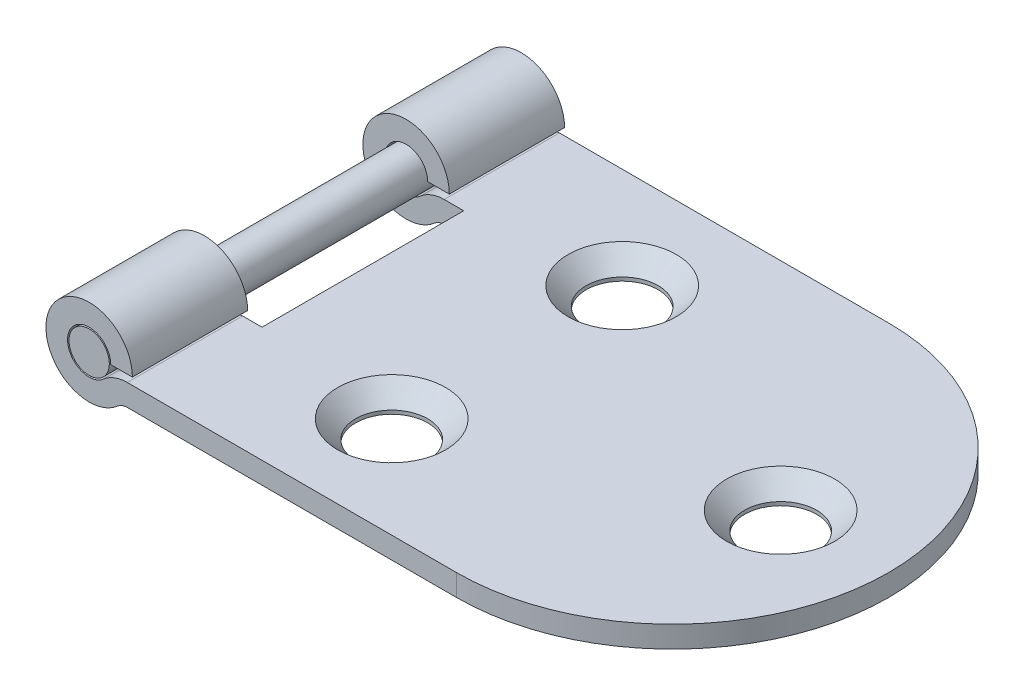
ISO-10303-21;
HEADER;
FILE_DESCRIPTION(('STEP AP214'),'2;1');
FILE_NAME('part.step','',(''),(''),'','','');
FILE_SCHEMA(('AUTOMOTIVE_DESIGN { 1 0 10303 214 1 1 1 1 }'));
ENDSEC;
DATA;
#1=APPLICATION_CONTEXT('core data for automotive mechanical design processes');
#2=APPLICATION_PROTOCOL_DEFINITION('international standard','automotive_design',2000,#1);
#3=PRODUCT_CONTEXT('',#1,'mechanical');
#4=PRODUCT('Part','Part','',(#3));
#5=PRODUCT_RELATED_PRODUCT_CATEGORY('part','',(#4));
#6=PRODUCT_DEFINITION_FORMATION('','',#4);
#7=PRODUCT_DEFINITION_CONTEXT('part definition',#1,'design');
#8=PRODUCT_DEFINITION('design','',#6,#7);
#9=PRODUCT_DEFINITION_SHAPE('','',#8);
#10=(LENGTH_UNIT() NAMED_UNIT(*) SI_UNIT(.MILLI.,.METRE.));
#11=(NAMED_UNIT(*) PLANE_ANGLE_UNIT() SI_UNIT($,.RADIAN.));
#12=(NAMED_UNIT(*) SI_UNIT($,.STERADIAN.) SOLID_ANGLE_UNIT());
#13=UNCERTAINTY_MEASURE_WITH_UNIT(LENGTH_MEASURE(1.E-05),#10,'distance_accuracy_value','');
#14=(GEOMETRIC_REPRESENTATION_CONTEXT(3) GLOBAL_UNCERTAINTY_ASSIGNED_CONTEXT((#13)) GLOBAL_UNIT_ASSIGNED_CONTEXT((#10,
#11,#12)) REPRESENTATION_CONTEXT('',''));
#15=CARTESIAN_POINT('',(0.,0.,0.));
#16=DIRECTION('',(0.,0.,1.));
#17=DIRECTION('',(1.,0.,0.));
#18=AXIS2_PLACEMENT_3D('',#15,#16,#17);
#19=CARTESIAN_POINT('',(0.,2.,18.9597979746447));
#20=DIRECTION('',(0.,0.,-1.));
#21=DIRECTION('',(-1.,0.,0.));
#22=AXIS2_PLACEMENT_3D('',#19,#20,#21);
#23=CYLINDRICAL_SURFACE('',#22,1.4);
#24=CARTESIAN_POINT('',(0.,2.,15.));
#25=DIRECTION('',(0.,0.,1.));
#26=DIRECTION('',(1.,0.,0.));
#27=AXIS2_PLACEMENT_3D('',#24,#25,#26);
#28=CIRCLE('',#27,1.4);
#29=CARTESIAN_POINT('',(1.4,2.,15.));
#30=VERTEX_POINT('',#29);
#31=EDGE_CURVE('E12',#30,#30,#28,.T.);
#32=ORIENTED_EDGE('',*,*,#31,.F.);
#33=EDGE_LOOP('',(#32));
#34=FACE_BOUND('',#33,.T.);
#35=CARTESIAN_POINT('',(0.,2.,-15.));
#36=DIRECTION('',(0.,0.,1.));
#37=DIRECTION('',(1.,0.,0.));
#38=AXIS2_PLACEMENT_3D('',#35,#36,#37);
#39=CIRCLE('',#38,1.4);
#40=CARTESIAN_POINT('',(1.4,2.,-15.));
#41=VERTEX_POINT('',#40);
#42=EDGE_CURVE('E73',#41,#41,#39,.F.);
#43=ORIENTED_EDGE('',*,*,#42,.F.);
#44=EDGE_LOOP('',(#43));
#45=FACE_BOUND('',#44,.T.);
#46=ADVANCED_FACE('F66',(#34,#45),#23,.T.);
#47=CARTESIAN_POINT('',(2.64575131106459,-1.,15.));
#48=DIRECTION('',(0.,0.,1.));
#49=DIRECTION('',(1.,0.,0.));
#50=AXIS2_PLACEMENT_3D('',#47,#48,#49);
#51=PLANE('',#50);
#52=ORIENTED_EDGE('',*,*,#31,.T.);
#53=EDGE_LOOP('',(#52));
#54=FACE_BOUND('',#53,.T.);
#55=ADVANCED_FACE('F68',(#54),#51,.T.);
#56=CARTESIAN_POINT('',(2.64575131106459,-1.,-15.));
#57=DIRECTION('',(0.,0.,1.));
#58=DIRECTION('',(1.,0.,0.));
#59=AXIS2_PLACEMENT_3D('',#56,#57,#58);
#60=PLANE('',#59);
#61=ORIENTED_EDGE('',*,*,#42,.T.);
#62=EDGE_LOOP('',(#61));
#63=FACE_BOUND('',#62,.T.);
#64=ADVANCED_FACE('F79',(#63),#60,.F.);
#65=CLOSED_SHELL('',(#46,#55,#64));
#66=MANIFOLD_SOLID_BREP('B2',#65);
#67=CARTESIAN_POINT('',(2.64575131106459,-1.,15.));
#68=DIRECTION('',(0.,0.,-1.));
#69=DIRECTION('',(-1.,0.,0.));
#70=AXIS2_PLACEMENT_3D('',#67,#68,#69);
#71=CYLINDRICAL_SURFACE('',#70,2.5);
#72=DIRECTION('',(0.,0.,-1.));
#73=VECTOR('',#72,1.);
#74=CARTESIAN_POINT('',(0.99215674164922,0.875,15.));
#75=LINE('',#74,#73);
#76=CARTESIAN_POINT('',(0.99215674164922,0.875,-7.));
#77=VERTEX_POINT('',#76);
#78=CARTESIAN_POINT('',(0.99215674164922,0.875,-15.));
#79=VERTEX_POINT('',#78);
#80=EDGE_CURVE('E348',#77,#79,#75,.T.);
#81=ORIENTED_EDGE('',*,*,#80,.F.);
#82=CARTESIAN_POINT('',(2.64575131106459,-1.,-7.));
#83=DIRECTION('',(0.,0.,-1.));
#84=DIRECTION('',(-1.,0.,0.));
#85=AXIS2_PLACEMENT_3D('',#82,#83,#84);
#86=CIRCLE('',#85,2.5);
#87=CARTESIAN_POINT('',(2.64575131106459,1.5,-7.));
#88=VERTEX_POINT('',#87);
#89=EDGE_CURVE('E253',#77,#88,#86,.T.);
#90=ORIENTED_EDGE('',*,*,#89,.T.);
#91=DIRECTION('',(0.,0.,-1.));
#92=VECTOR('',#91,1.);
#93=CARTESIAN_POINT('',(2.64575131106459,1.5,15.));
#94=LINE('',#93,#92);
#95=CARTESIAN_POINT('',(2.64575131106459,1.5,-15.));
#96=VERTEX_POINT('',#95);
#97=EDGE_CURVE('E311',#88,#96,#94,.T.);
#98=ORIENTED_EDGE('',*,*,#97,.T.);
#99=CARTESIAN_POINT('',(2.64575131106459,-1.,-15.));
#100=DIRECTION('',(0.,0.,1.));
#101=DIRECTION('',(1.,0.,0.));
#102=AXIS2_PLACEMENT_3D('',#99,#100,#101);
#103=CIRCLE('',#102,2.5);
#104=EDGE_CURVE('E293',#96,#79,#103,.T.);
#105=ORIENTED_EDGE('',*,*,#104,.T.);
#106=EDGE_LOOP('',(#81,#90,#98,#105));
#107=FACE_BOUND('',#106,.T.);
#108=ADVANCED_FACE('F106',(#107),#71,.T.);
#109=CARTESIAN_POINT('',(0.,2.,15.));
#110=DIRECTION('',(0.,0.,-1.));
#111=DIRECTION('',(-1.,0.,0.));
#112=AXIS2_PLACEMENT_3D('',#109,#110,#111);
#113=CYLINDRICAL_SURFACE('',#112,1.5);
#114=DIRECTION('',(0.,0.,-1.));
#115=VECTOR('',#114,1.);
#116=CARTESIAN_POINT('',(1.5,2.,15.));
#117=LINE('',#116,#115);
#118=CARTESIAN_POINT('',(1.5,2.,-7.));
#119=VERTEX_POINT('',#118);
#120=CARTESIAN_POINT('',(1.5,2.,-15.));
#121=VERTEX_POINT('',#120);
#122=EDGE_CURVE('E344',#119,#121,#117,.T.);
#123=ORIENTED_EDGE('',*,*,#122,.F.);
#124=CARTESIAN_POINT('',(0.,2.,-7.));
#125=DIRECTION('',(0.,0.,-1.));
#126=DIRECTION('',(-1.,0.,0.));
#127=AXIS2_PLACEMENT_3D('',#124,#125,#126);
#128=CIRCLE('',#127,1.5);
#129=EDGE_CURVE('E250',#119,#77,#128,.F.);
#130=ORIENTED_EDGE('',*,*,#129,.T.);
#131=ORIENTED_EDGE('',*,*,#80,.T.);
#132=CARTESIAN_POINT('',(0.,2.,-15.));
#133=DIRECTION('',(0.,0.,-1.));
#134=DIRECTION('',(1.,0.,0.));
#135=AXIS2_PLACEMENT_3D('',#132,#133,#134);
#136=CIRCLE('',#135,1.5);
#137=EDGE_CURVE('E314',#79,#121,#136,.T.);
#138=ORIENTED_EDGE('',*,*,#137,.T.);
#139=EDGE_LOOP('',(#123,#130,#131,#138));
#140=FACE_BOUND('',#139,.T.);
#141=ADVANCED_FACE('F387',(#140),#113,.F.);
#142=CARTESIAN_POINT('',(1.5,2.,15.));
#143=DIRECTION('',(0.,1.,0.));
#144=DIRECTION('',(0.,0.,1.));
#145=AXIS2_PLACEMENT_3D('',#142,#143,#144);
#146=PLANE('',#145);
#147=DIRECTION('',(0.,0.,-1.));
#148=VECTOR('',#147,1.);
#149=CARTESIAN_POINT('',(3.,2.,15.));
#150=LINE('',#149,#148);
#151=CARTESIAN_POINT('',(3.,2.,-7.));
#152=VERTEX_POINT('',#151);
#153=CARTESIAN_POINT('',(3.,2.,-15.));
#154=VERTEX_POINT('',#153);
#155=EDGE_CURVE('E340',#152,#154,#150,.T.);
#156=ORIENTED_EDGE('',*,*,#155,.F.);
#157=DIRECTION('',(-1.,0.,0.));
#158=VECTOR('',#157,1.);
#159=CARTESIAN_POINT('',(1.49999999999999,2.,-7.));
#160=LINE('',#159,#158);
#161=EDGE_CURVE('E247',#152,#119,#160,.T.);
#162=ORIENTED_EDGE('',*,*,#161,.T.);
#163=ORIENTED_EDGE('',*,*,#122,.T.);
#164=DIRECTION('',(1.,0.,0.));
#165=VECTOR('',#164,1.);
#166=CARTESIAN_POINT('',(1.5,2.,-15.));
#167=LINE('',#166,#165);
#168=EDGE_CURVE('E317',#121,#154,#167,.T.);
#169=ORIENTED_EDGE('',*,*,#168,.T.);
#170=EDGE_LOOP('',(#156,#162,#163,#169));
#171=FACE_BOUND('',#170,.T.);
#172=ADVANCED_FACE('F390',(#171),#146,.F.);
#173=CARTESIAN_POINT('',(0.,2.,15.));
#174=DIRECTION('',(0.,0.,-1.));
#175=DIRECTION('',(-1.,0.,0.));
#176=AXIS2_PLACEMENT_3D('',#173,#174,#175);
#177=CYLINDRICAL_SURFACE('',#176,3.);
#178=DIRECTION('',(0.,0.,-1.));
#179=VECTOR('',#178,1.);
#180=CARTESIAN_POINT('',(1.98431348329844,-0.25,15.));
#181=LINE('',#180,#179);
#182=CARTESIAN_POINT('',(1.98431348329844,-0.25,-7.));
#183=VERTEX_POINT('',#182);
#184=CARTESIAN_POINT('',(1.98431348329844,-0.25,-15.));
#185=VERTEX_POINT('',#184);
#186=EDGE_CURVE('E336',#183,#185,#181,.T.);
#187=ORIENTED_EDGE('',*,*,#186,.F.);
#188=CARTESIAN_POINT('',(0.,2.,-7.));
#189=DIRECTION('',(0.,0.,-1.));
#190=DIRECTION('',(-1.,0.,0.));
#191=AXIS2_PLACEMENT_3D('',#188,#189,#190);
#192=CIRCLE('',#191,3.);
#193=EDGE_CURVE('E238',#183,#152,#192,.T.);
#194=ORIENTED_EDGE('',*,*,#193,.T.);
#195=ORIENTED_EDGE('',*,*,#155,.T.);
#196=CARTESIAN_POINT('',(0.,2.,-15.));
#197=DIRECTION('',(0.,0.,1.));
#198=DIRECTION('',(1.,0.,0.));
#199=AXIS2_PLACEMENT_3D('',#196,#197,#198);
#200=CIRCLE('',#199,3.);
#201=EDGE_CURVE('E320',#154,#185,#200,.T.);
#202=ORIENTED_EDGE('',*,*,#201,.T.);
#203=EDGE_LOOP('',(#187,#194,#195,#202));
#204=FACE_BOUND('',#203,.T.);
#205=ADVANCED_FACE('F364',(#204),#177,.T.);
#206=CARTESIAN_POINT('',(2.64575131106459,-1.,15.));
#207=DIRECTION('',(0.,0.,-1.));
#208=DIRECTION('',(-1.,0.,0.));
#209=AXIS2_PLACEMENT_3D('',#206,#207,#208);
#210=CYLINDRICAL_SURFACE('',#209,1.);
#211=DIRECTION('',(0.,0.,-1.));
#212=VECTOR('',#211,1.);
#213=CARTESIAN_POINT('',(2.64575131106459,0.,15.));
#214=LINE('',#213,#212);
#215=CARTESIAN_POINT('',(2.64575131106459,0.,-7.));
#216=VERTEX_POINT('',#215);
#217=CARTESIAN_POINT('',(2.64575131106459,0.,-15.));
#218=VERTEX_POINT('',#217);
#219=EDGE_CURVE('E334',#216,#218,#214,.T.);
#220=ORIENTED_EDGE('',*,*,#219,.F.);
#221=CARTESIAN_POINT('',(2.64575131106459,-1.,-7.));
#222=DIRECTION('',(0.,0.,-1.));
#223=DIRECTION('',(-1.,0.,0.));
#224=AXIS2_PLACEMENT_3D('',#221,#222,#223);
#225=CIRCLE('',#224,1.);
#226=EDGE_CURVE('E114',#216,#183,#225,.F.);
#227=ORIENTED_EDGE('',*,*,#226,.T.);
#228=ORIENTED_EDGE('',*,*,#186,.T.);
#229=CARTESIAN_POINT('',(2.64575131106459,-1.,-15.));
#230=DIRECTION('',(0.,0.,-1.));
#231=DIRECTION('',(1.,0.,0.));
#232=AXIS2_PLACEMENT_3D('',#229,#230,#231);
#233=CIRCLE('',#232,1.);
#234=EDGE_CURVE('E323',#185,#218,#233,.T.);
#235=ORIENTED_EDGE('',*,*,#234,.T.);
#236=EDGE_LOOP('',(#220,#227,#228,#235));
#237=FACE_BOUND('',#236,.T.);
#238=ADVANCED_FACE('F361',(#237),#210,.F.);
#239=CARTESIAN_POINT('',(2.64575131106459,1.5,15.));
#240=DIRECTION('',(0.,-1.,0.));
#241=DIRECTION('',(1.,0.,0.));
#242=AXIS2_PLACEMENT_3D('',#239,#240,#241);
#243=PLANE('',#242);
#244=CARTESIAN_POINT('',(14.,1.5,-8.));
#245=DIRECTION('',(0.,1.,0.));
#246=DIRECTION('',(0.,0.,1.));
#247=AXIS2_PLACEMENT_3D('',#244,#245,#246);
#248=CIRCLE('',#247,3.75);
#249=CARTESIAN_POINT('',(14.,1.5,-4.25));
#250=VERTEX_POINT('',#249);
#251=EDGE_CURVE('E263',#250,#250,#248,.T.);
#252=ORIENTED_EDGE('',*,*,#251,.F.);
#253=EDGE_LOOP('',(#252));
#254=FACE_BOUND('',#253,.T.);
#255=CARTESIAN_POINT('',(14.,1.5,8.));
#256=DIRECTION('',(0.,1.,0.));
#257=DIRECTION('',(0.,0.,1.));
#258=AXIS2_PLACEMENT_3D('',#255,#256,#257);
#259=CIRCLE('',#258,3.75);
#260=CARTESIAN_POINT('',(14.,1.5,11.75));
#261=VERTEX_POINT('',#260);
#262=EDGE_CURVE('E269',#261,#261,#259,.T.);
#263=ORIENTED_EDGE('',*,*,#262,.F.);
#264=EDGE_LOOP('',(#263));
#265=FACE_BOUND('',#264,.T.);
#266=ORIENTED_EDGE('',*,*,#97,.F.);
#267=DIRECTION('',(1.,0.,0.));
#268=VECTOR('',#267,1.);
#269=CARTESIAN_POINT('',(2.64575131106458,1.5,-7.));
#270=LINE('',#269,#268);
#271=CARTESIAN_POINT('',(4.,1.5,-7.));
#272=VERTEX_POINT('',#271);
#273=EDGE_CURVE('E258',#88,#272,#270,.T.);
#274=ORIENTED_EDGE('',*,*,#273,.T.);
#275=DIRECTION('',(0.,0.,1.));
#276=VECTOR('',#275,1.);
#277=CARTESIAN_POINT('',(4.,1.5,15.));
#278=LINE('',#277,#276);
#279=CARTESIAN_POINT('',(4.,1.5,7.));
#280=VERTEX_POINT('',#279);
#281=EDGE_CURVE('E261',#272,#280,#278,.T.);
#282=ORIENTED_EDGE('',*,*,#281,.T.);
#283=DIRECTION('',(-1.,0.,0.));
#284=VECTOR('',#283,1.);
#285=CARTESIAN_POINT('',(2.64575131106459,1.5,7.));
#286=LINE('',#285,#284);
#287=CARTESIAN_POINT('',(2.64575131106459,1.5,7.));
#288=VERTEX_POINT('',#287);
#289=EDGE_CURVE('E229',#280,#288,#286,.T.);
#290=ORIENTED_EDGE('',*,*,#289,.T.);
#291=CARTESIAN_POINT('',(2.64575131106459,1.5,15.));
#292=VERTEX_POINT('',#291);
#293=EDGE_CURVE('E331',#292,#288,#94,.T.);
#294=ORIENTED_EDGE('',*,*,#293,.F.);
#295=DIRECTION('',(-1.,0.,0.));
#296=VECTOR('',#295,1.);
#297=CARTESIAN_POINT('',(2.64575131106459,1.5,15.));
#298=LINE('',#297,#296);
#299=CARTESIAN_POINT('',(25.5,1.5,15.));
#300=VERTEX_POINT('',#299);
#301=EDGE_CURVE('E309',#300,#292,#298,.T.);
#302=ORIENTED_EDGE('',*,*,#301,.F.);
#303=CARTESIAN_POINT('',(25.5,1.5,0.));
#304=DIRECTION('',(0.,1.,0.));
#305=DIRECTION('',(-1.,0.,0.));
#306=AXIS2_PLACEMENT_3D('',#303,#304,#305);
#307=CIRCLE('',#306,15.);
#308=CARTESIAN_POINT('',(25.5,1.5,-15.));
#309=VERTEX_POINT('',#308);
#310=EDGE_CURVE('E129',#300,#309,#307,.T.);
#311=ORIENTED_EDGE('',*,*,#310,.T.);
#312=DIRECTION('',(-1.,0.,0.));
#313=VECTOR('',#312,1.);
#314=CARTESIAN_POINT('',(2.64575131106459,1.5,-15.));
#315=LINE('',#314,#313);
#316=EDGE_CURVE('E298',#309,#96,#315,.T.);
#317=ORIENTED_EDGE('',*,*,#316,.T.);
#318=EDGE_LOOP('',(#266,#274,#282,#290,#294,#302,#311,#317));
#319=FACE_BOUND('',#318,.T.);
#320=CARTESIAN_POINT('',(33.,1.5,0.));
#321=DIRECTION('',(0.,1.,0.));
#322=DIRECTION('',(0.,0.,1.));
#323=AXIS2_PLACEMENT_3D('',#320,#321,#322);
#324=CIRCLE('',#323,3.75);
#325=CARTESIAN_POINT('',(33.,1.5,3.75));
#326=VERTEX_POINT('',#325);
#327=EDGE_CURVE('E275',#326,#326,#324,.T.);
#328=ORIENTED_EDGE('',*,*,#327,.F.);
#329=EDGE_LOOP('',(#328));
#330=FACE_BOUND('',#329,.T.);
#331=ADVANCED_FACE('F380',(#254,#265,#319,#330),#243,.F.);
#332=CARTESIAN_POINT('',(2.64575131106459,0.,15.));
#333=DIRECTION('',(0.,1.,0.));
#334=DIRECTION('',(0.,0.,1.));
#335=AXIS2_PLACEMENT_3D('',#332,#333,#334);
#336=PLANE('',#335);
#337=CARTESIAN_POINT('',(14.,0.,8.));
#338=DIRECTION('',(0.,1.,0.));
#339=DIRECTION('',(0.,0.,1.));
#340=AXIS2_PLACEMENT_3D('',#337,#338,#339);
#341=CIRCLE('',#340,2.5);
#342=CARTESIAN_POINT('',(14.,0.,10.5));
#343=VERTEX_POINT('',#342);
#344=EDGE_CURVE('E290',#343,#343,#341,.T.);
#345=ORIENTED_EDGE('',*,*,#344,.T.);
#346=EDGE_LOOP('',(#345));
#347=FACE_BOUND('',#346,.T.);
#348=CARTESIAN_POINT('',(14.,0.,-8.));
#349=DIRECTION('',(0.,1.,0.));
#350=DIRECTION('',(0.,0.,1.));
#351=AXIS2_PLACEMENT_3D('',#348,#349,#350);
#352=CIRCLE('',#351,2.5);
#353=CARTESIAN_POINT('',(14.,0.,-5.5));
#354=VERTEX_POINT('',#353);
#355=EDGE_CURVE('E287',#354,#354,#352,.T.);
#356=ORIENTED_EDGE('',*,*,#355,.T.);
#357=EDGE_LOOP('',(#356));
#358=FACE_BOUND('',#357,.T.);
#359=CARTESIAN_POINT('',(33.,0.,0.));
#360=DIRECTION('',(0.,1.,0.));
#361=DIRECTION('',(0.,0.,1.));
#362=AXIS2_PLACEMENT_3D('',#359,#360,#361);
#363=CIRCLE('',#362,2.5);
#364=CARTESIAN_POINT('',(33.,0.,2.5));
#365=VERTEX_POINT('',#364);
#366=EDGE_CURVE('E284',#365,#365,#363,.T.);
#367=ORIENTED_EDGE('',*,*,#366,.T.);
#368=EDGE_LOOP('',(#367));
#369=FACE_BOUND('',#368,.T.);
#370=DIRECTION('',(0.,0.,-1.));
#371=VECTOR('',#370,1.);
#372=CARTESIAN_POINT('',(4.,0.,15.));
#373=LINE('',#372,#371);
#374=CARTESIAN_POINT('',(4.,0.,7.));
#375=VERTEX_POINT('',#374);
#376=CARTESIAN_POINT('',(4.,0.,-7.));
#377=VERTEX_POINT('',#376);
#378=EDGE_CURVE('E64',#375,#377,#373,.T.);
#379=ORIENTED_EDGE('',*,*,#378,.T.);
#380=DIRECTION('',(-1.,0.,0.));
#381=VECTOR('',#380,1.);
#382=CARTESIAN_POINT('',(2.64575131106458,0.,-7.));
#383=LINE('',#382,#381);
#384=EDGE_CURVE('E256',#377,#216,#383,.T.);
#385=ORIENTED_EDGE('',*,*,#384,.T.);
#386=ORIENTED_EDGE('',*,*,#219,.T.);
#387=DIRECTION('',(1.,0.,0.));
#388=VECTOR('',#387,1.);
#389=CARTESIAN_POINT('',(2.64575131106459,0.,-15.));
#390=LINE('',#389,#388);
#391=CARTESIAN_POINT('',(25.5,0.,-15.));
#392=VERTEX_POINT('',#391);
#393=EDGE_CURVE('E326',#218,#392,#390,.T.);
#394=ORIENTED_EDGE('',*,*,#393,.T.);
#395=CARTESIAN_POINT('',(25.5,0.,0.));
#396=DIRECTION('',(0.,1.,0.));
#397=DIRECTION('',(0.,0.,1.));
#398=AXIS2_PLACEMENT_3D('',#395,#396,#397);
#399=CIRCLE('',#398,15.);
#400=CARTESIAN_POINT('',(25.5,0.,15.));
#401=VERTEX_POINT('',#400);
#402=EDGE_CURVE('E282',#401,#392,#399,.T.);
#403=ORIENTED_EDGE('',*,*,#402,.F.);
#404=DIRECTION('',(1.,0.,0.));
#405=VECTOR('',#404,1.);
#406=CARTESIAN_POINT('',(2.64575131106459,0.,15.));
#407=LINE('',#406,#405);
#408=CARTESIAN_POINT('',(2.64575131106459,0.,15.));
#409=VERTEX_POINT('',#408);
#410=EDGE_CURVE('E306',#409,#401,#407,.T.);
#411=ORIENTED_EDGE('',*,*,#410,.F.);
#412=CARTESIAN_POINT('',(2.64575131106459,0.,7.));
#413=VERTEX_POINT('',#412);
#414=EDGE_CURVE('E235',#409,#413,#214,.T.);
#415=ORIENTED_EDGE('',*,*,#414,.T.);
#416=DIRECTION('',(1.,0.,0.));
#417=VECTOR('',#416,1.);
#418=CARTESIAN_POINT('',(2.64575131106459,0.,7.));
#419=LINE('',#418,#417);
#420=EDGE_CURVE('E121',#413,#375,#419,.T.);
#421=ORIENTED_EDGE('',*,*,#420,.T.);
#422=EDGE_LOOP('',(#379,#385,#386,#394,#403,#411,#415,#421));
#423=FACE_BOUND('',#422,.T.);
#424=ADVANCED_FACE('F232',(#347,#358,#369,#423),#336,.F.);
#425=CARTESIAN_POINT('',(2.64575131106459,-1.,-15.));
#426=DIRECTION('',(0.,0.,1.));
#427=DIRECTION('',(1.,0.,0.));
#428=AXIS2_PLACEMENT_3D('',#425,#426,#427);
#429=PLANE('',#428);
#430=DIRECTION('',(0.,1.,0.));
#431=VECTOR('',#430,1.);
#432=CARTESIAN_POINT('',(25.5,-28.5,-15.));
#433=LINE('',#432,#431);
#434=EDGE_CURVE('E354',#392,#309,#433,.T.);
#435=ORIENTED_EDGE('',*,*,#434,.F.);
#436=ORIENTED_EDGE('',*,*,#393,.F.);
#437=ORIENTED_EDGE('',*,*,#234,.F.);
#438=ORIENTED_EDGE('',*,*,#201,.F.);
#439=ORIENTED_EDGE('',*,*,#168,.F.);
#440=ORIENTED_EDGE('',*,*,#137,.F.);
#441=ORIENTED_EDGE('',*,*,#104,.F.);
#442=ORIENTED_EDGE('',*,*,#316,.F.);
#443=EDGE_LOOP('',(#435,#436,#437,#438,#439,#440,#441,#442));
#444=FACE_BOUND('',#443,.T.);
#445=ADVANCED_FACE('F372',(#444),#429,.F.);
#446=CARTESIAN_POINT('',(2.64575131106459,-1.,15.));
#447=DIRECTION('',(0.,0.,1.));
#448=DIRECTION('',(1.,0.,0.));
#449=AXIS2_PLACEMENT_3D('',#446,#447,#448);
#450=PLANE('',#449);
#451=ORIENTED_EDGE('',*,*,#410,.T.);
#452=DIRECTION('',(0.,1.,0.));
#453=VECTOR('',#452,1.);
#454=CARTESIAN_POINT('',(25.5,-28.5,15.));
#455=LINE('',#454,#453);
#456=EDGE_CURVE('E352',#401,#300,#455,.T.);
#457=ORIENTED_EDGE('',*,*,#456,.T.);
#458=ORIENTED_EDGE('',*,*,#301,.T.);
#459=CARTESIAN_POINT('',(2.64575131106459,-1.,15.));
#460=DIRECTION('',(0.,0.,1.));
#461=DIRECTION('',(1.,0.,0.));
#462=AXIS2_PLACEMENT_3D('',#459,#460,#461);
#463=CIRCLE('',#462,2.5);
#464=CARTESIAN_POINT('',(0.99215674164922,0.875,15.));
#465=VERTEX_POINT('',#464);
#466=EDGE_CURVE('E294',#292,#465,#463,.T.);
#467=ORIENTED_EDGE('',*,*,#466,.T.);
#468=CARTESIAN_POINT('',(0.,2.,15.));
#469=DIRECTION('',(0.,0.,-1.));
#470=DIRECTION('',(1.,0.,0.));
#471=AXIS2_PLACEMENT_3D('',#468,#469,#470);
#472=CIRCLE('',#471,1.5);
#473=CARTESIAN_POINT('',(1.5,2.,15.));
#474=VERTEX_POINT('',#473);
#475=EDGE_CURVE('E297',#465,#474,#472,.T.);
#476=ORIENTED_EDGE('',*,*,#475,.T.);
#477=DIRECTION('',(1.,0.,0.));
#478=VECTOR('',#477,1.);
#479=CARTESIAN_POINT('',(1.5,2.,15.));
#480=LINE('',#479,#478);
#481=CARTESIAN_POINT('',(3.,2.,15.));
#482=VERTEX_POINT('',#481);
#483=EDGE_CURVE('E300',#474,#482,#480,.T.);
#484=ORIENTED_EDGE('',*,*,#483,.T.);
#485=CARTESIAN_POINT('',(0.,2.,15.));
#486=DIRECTION('',(0.,0.,1.));
#487=DIRECTION('',(1.,0.,0.));
#488=AXIS2_PLACEMENT_3D('',#485,#486,#487);
#489=CIRCLE('',#488,3.);
#490=CARTESIAN_POINT('',(1.98431348329844,-0.25,15.));
#491=VERTEX_POINT('',#490);
#492=EDGE_CURVE('E302',#482,#491,#489,.T.);
#493=ORIENTED_EDGE('',*,*,#492,.T.);
#494=CARTESIAN_POINT('',(2.64575131106459,-1.,15.));
#495=DIRECTION('',(0.,0.,-1.));
#496=DIRECTION('',(1.,0.,0.));
#497=AXIS2_PLACEMENT_3D('',#494,#495,#496);
#498=CIRCLE('',#497,1.);
#499=EDGE_CURVE('E304',#491,#409,#498,.T.);
#500=ORIENTED_EDGE('',*,*,#499,.T.);
#501=EDGE_LOOP('',(#451,#457,#458,#467,#476,#484,#493,#500));
#502=FACE_BOUND('',#501,.T.);
#503=ADVANCED_FACE('F407',(#502),#450,.T.);
#504=ORIENTED_EDGE('',*,*,#293,.T.);
#505=CARTESIAN_POINT('',(2.64575131106459,-1.,7.));
#506=DIRECTION('',(0.,0.,1.));
#507=DIRECTION('',(1.,0.,0.));
#508=AXIS2_PLACEMENT_3D('',#505,#506,#507);
#509=CIRCLE('',#508,2.5);
#510=CARTESIAN_POINT('',(0.99215674164922,0.875,7.));
#511=VERTEX_POINT('',#510);
#512=EDGE_CURVE('E236',#288,#511,#509,.T.);
#513=ORIENTED_EDGE('',*,*,#512,.T.);
#514=EDGE_CURVE('E349',#465,#511,#75,.T.);
#515=ORIENTED_EDGE('',*,*,#514,.F.);
#516=ORIENTED_EDGE('',*,*,#466,.F.);
#517=EDGE_LOOP('',(#504,#513,#515,#516));
#518=FACE_BOUND('',#517,.T.);
#519=ADVANCED_FACE('F108',(#518),#71,.T.);
#520=ORIENTED_EDGE('',*,*,#514,.T.);
#521=CARTESIAN_POINT('',(0.,2.,7.));
#522=DIRECTION('',(0.,0.,1.));
#523=DIRECTION('',(1.,0.,0.));
#524=AXIS2_PLACEMENT_3D('',#521,#522,#523);
#525=CIRCLE('',#524,1.5);
#526=CARTESIAN_POINT('',(1.5,2.,7.));
#527=VERTEX_POINT('',#526);
#528=EDGE_CURVE('E241',#511,#527,#525,.F.);
#529=ORIENTED_EDGE('',*,*,#528,.T.);
#530=EDGE_CURVE('E345',#474,#527,#117,.T.);
#531=ORIENTED_EDGE('',*,*,#530,.F.);
#532=ORIENTED_EDGE('',*,*,#475,.F.);
#533=EDGE_LOOP('',(#520,#529,#531,#532));
#534=FACE_BOUND('',#533,.T.);
#535=ADVANCED_FACE('F400',(#534),#113,.F.);
#536=ORIENTED_EDGE('',*,*,#530,.T.);
#537=DIRECTION('',(1.,0.,0.));
#538=VECTOR('',#537,1.);
#539=CARTESIAN_POINT('',(1.5,2.,7.));
#540=LINE('',#539,#538);
#541=CARTESIAN_POINT('',(3.,2.,7.));
#542=VERTEX_POINT('',#541);
#543=EDGE_CURVE('E455',#527,#542,#540,.T.);
#544=ORIENTED_EDGE('',*,*,#543,.T.);
#545=EDGE_CURVE('E341',#482,#542,#150,.T.);
#546=ORIENTED_EDGE('',*,*,#545,.F.);
#547=ORIENTED_EDGE('',*,*,#483,.F.);
#548=EDGE_LOOP('',(#536,#544,#546,#547));
#549=FACE_BOUND('',#548,.T.);
#550=ADVANCED_FACE('F393',(#549),#146,.F.);
#551=ORIENTED_EDGE('',*,*,#545,.T.);
#552=CARTESIAN_POINT('',(0.,2.,7.));
#553=DIRECTION('',(0.,0.,1.));
#554=DIRECTION('',(1.,0.,0.));
#555=AXIS2_PLACEMENT_3D('',#552,#553,#554);
#556=CIRCLE('',#555,3.);
#557=CARTESIAN_POINT('',(1.98431348329844,-0.25,7.));
#558=VERTEX_POINT('',#557);
#559=EDGE_CURVE('E376',#542,#558,#556,.T.);
#560=ORIENTED_EDGE('',*,*,#559,.T.);
#561=EDGE_CURVE('E337',#491,#558,#181,.T.);
#562=ORIENTED_EDGE('',*,*,#561,.F.);
#563=ORIENTED_EDGE('',*,*,#492,.F.);
#564=EDGE_LOOP('',(#551,#560,#562,#563));
#565=FACE_BOUND('',#564,.T.);
#566=ADVANCED_FACE('F399',(#565),#177,.T.);
#567=ORIENTED_EDGE('',*,*,#561,.T.);
#568=CARTESIAN_POINT('',(2.64575131106459,-1.,7.));
#569=DIRECTION('',(0.,0.,1.));
#570=DIRECTION('',(1.,0.,0.));
#571=AXIS2_PLACEMENT_3D('',#568,#569,#570);
#572=CIRCLE('',#571,1.);
#573=EDGE_CURVE('E356',#558,#413,#572,.F.);
#574=ORIENTED_EDGE('',*,*,#573,.T.);
#575=ORIENTED_EDGE('',*,*,#414,.F.);
#576=ORIENTED_EDGE('',*,*,#499,.F.);
#577=EDGE_LOOP('',(#567,#574,#575,#576));
#578=FACE_BOUND('',#577,.T.);
#579=ADVANCED_FACE('F423',(#578),#210,.F.);
#580=CARTESIAN_POINT('',(25.5,-28.5,0.));
#581=DIRECTION('',(0.,1.,0.));
#582=DIRECTION('',(-1.,0.,0.));
#583=AXIS2_PLACEMENT_3D('',#580,#581,#582);
#584=CYLINDRICAL_SURFACE('',#583,15.);
#585=ORIENTED_EDGE('',*,*,#402,.T.);
#586=ORIENTED_EDGE('',*,*,#434,.T.);
#587=ORIENTED_EDGE('',*,*,#310,.F.);
#588=ORIENTED_EDGE('',*,*,#456,.F.);
#589=EDGE_LOOP('',(#585,#586,#587,#588));
#590=FACE_BOUND('',#589,.T.);
#591=ADVANCED_FACE('F420',(#590),#584,.T.);
#592=CARTESIAN_POINT('',(33.,-28.5,0.));
#593=DIRECTION('',(0.,1.,0.));
#594=DIRECTION('',(-1.,0.,0.));
#595=AXIS2_PLACEMENT_3D('',#592,#593,#594);
#596=CYLINDRICAL_SURFACE('',#595,2.5);
#597=CARTESIAN_POINT('',(33.,0.249999999999999,0.));
#598=DIRECTION('',(0.,1.,0.));
#599=DIRECTION('',(0.,0.,1.));
#600=AXIS2_PLACEMENT_3D('',#597,#598,#599);
#601=CIRCLE('',#600,2.5);
#602=CARTESIAN_POINT('',(33.,0.249999999999999,2.5));
#603=VERTEX_POINT('',#602);
#604=EDGE_CURVE('E278',#603,#603,#601,.T.);
#605=ORIENTED_EDGE('',*,*,#604,.T.);
#606=EDGE_LOOP('',(#605));
#607=FACE_BOUND('',#606,.T.);
#608=ORIENTED_EDGE('',*,*,#366,.F.);
#609=EDGE_LOOP('',(#608));
#610=FACE_BOUND('',#609,.T.);
#611=ADVANCED_FACE('F422',(#607,#610),#596,.F.);
#612=CARTESIAN_POINT('',(14.,-28.5,-8.));
#613=DIRECTION('',(0.,1.,0.));
#614=DIRECTION('',(-1.,0.,0.));
#615=AXIS2_PLACEMENT_3D('',#612,#613,#614);
#616=CYLINDRICAL_SURFACE('',#615,2.5);
#617=CARTESIAN_POINT('',(14.,0.249999999999999,-8.));
#618=DIRECTION('',(0.,1.,0.));
#619=DIRECTION('',(0.,0.,1.));
#620=AXIS2_PLACEMENT_3D('',#617,#618,#619);
#621=CIRCLE('',#620,2.5);
#622=CARTESIAN_POINT('',(14.,0.249999999999999,-5.5));
#623=VERTEX_POINT('',#622);
#624=EDGE_CURVE('E266',#623,#623,#621,.T.);
#625=ORIENTED_EDGE('',*,*,#624,.T.);
#626=EDGE_LOOP('',(#625));
#627=FACE_BOUND('',#626,.T.);
#628=ORIENTED_EDGE('',*,*,#355,.F.);
#629=EDGE_LOOP('',(#628));
#630=FACE_BOUND('',#629,.T.);
#631=ADVANCED_FACE('F429',(#627,#630),#616,.F.);
#632=CARTESIAN_POINT('',(14.,-28.5,8.));
#633=DIRECTION('',(0.,1.,0.));
#634=DIRECTION('',(-1.,0.,0.));
#635=AXIS2_PLACEMENT_3D('',#632,#633,#634);
#636=CYLINDRICAL_SURFACE('',#635,2.5);
#637=CARTESIAN_POINT('',(14.,0.249999999999999,8.));
#638=DIRECTION('',(0.,1.,0.));
#639=DIRECTION('',(0.,0.,1.));
#640=AXIS2_PLACEMENT_3D('',#637,#638,#639);
#641=CIRCLE('',#640,2.5);
#642=CARTESIAN_POINT('',(14.,0.249999999999999,10.5));
#643=VERTEX_POINT('',#642);
#644=EDGE_CURVE('E272',#643,#643,#641,.T.);
#645=ORIENTED_EDGE('',*,*,#644,.T.);
#646=EDGE_LOOP('',(#645));
#647=FACE_BOUND('',#646,.T.);
#648=ORIENTED_EDGE('',*,*,#344,.F.);
#649=EDGE_LOOP('',(#648));
#650=FACE_BOUND('',#649,.T.);
#651=ADVANCED_FACE('F435',(#647,#650),#636,.F.);
#652=CARTESIAN_POINT('',(33.,1.5,0.));
#653=DIRECTION('',(0.,1.,0.));
#654=DIRECTION('',(0.,0.,1.));
#655=AXIS2_PLACEMENT_3D('',#652,#653,#654);
#656=CONICAL_SURFACE('',#655,3.75,0.785398163397448);
#657=ORIENTED_EDGE('',*,*,#604,.F.);
#658=EDGE_LOOP('',(#657));
#659=FACE_BOUND('',#658,.T.);
#660=ORIENTED_EDGE('',*,*,#327,.T.);
#661=EDGE_LOOP('',(#660));
#662=FACE_BOUND('',#661,.T.);
#663=ADVANCED_FACE('F505',(#659,#662),#656,.F.);
#664=CARTESIAN_POINT('',(14.,1.5,8.));
#665=DIRECTION('',(0.,1.,0.));
#666=DIRECTION('',(0.,0.,1.));
#667=AXIS2_PLACEMENT_3D('',#664,#665,#666);
#668=CONICAL_SURFACE('',#667,3.75,0.785398163397447);
#669=ORIENTED_EDGE('',*,*,#644,.F.);
#670=EDGE_LOOP('',(#669));
#671=FACE_BOUND('',#670,.T.);
#672=ORIENTED_EDGE('',*,*,#262,.T.);
#673=EDGE_LOOP('',(#672));
#674=FACE_BOUND('',#673,.T.);
#675=ADVANCED_FACE('F501',(#671,#674),#668,.F.);
#676=CARTESIAN_POINT('',(14.,1.5,-8.));
#677=DIRECTION('',(0.,1.,0.));
#678=DIRECTION('',(0.,0.,1.));
#679=AXIS2_PLACEMENT_3D('',#676,#677,#678);
#680=CONICAL_SURFACE('',#679,3.75,0.785398163397447);
#681=ORIENTED_EDGE('',*,*,#624,.F.);
#682=EDGE_LOOP('',(#681));
#683=FACE_BOUND('',#682,.T.);
#684=ORIENTED_EDGE('',*,*,#251,.T.);
#685=EDGE_LOOP('',(#684));
#686=FACE_BOUND('',#685,.T.);
#687=ADVANCED_FACE('F477',(#683,#686),#680,.F.);
#688=CARTESIAN_POINT('',(4.,-13.5,-7.));
#689=DIRECTION('',(1.,0.,0.));
#690=DIRECTION('',(0.,0.,-1.));
#691=AXIS2_PLACEMENT_3D('',#688,#689,#690);
#692=PLANE('',#691);
#693=DIRECTION('',(0.,1.,0.));
#694=VECTOR('',#693,1.);
#695=CARTESIAN_POINT('',(4.,-13.5,-7.));
#696=LINE('',#695,#694);
#697=EDGE_CURVE('E224',#377,#272,#696,.T.);
#698=ORIENTED_EDGE('',*,*,#697,.F.);
#699=ORIENTED_EDGE('',*,*,#378,.F.);
#700=DIRECTION('',(0.,1.,0.));
#701=VECTOR('',#700,1.);
#702=CARTESIAN_POINT('',(4.,-13.5,7.));
#703=LINE('',#702,#701);
#704=EDGE_CURVE('E221',#375,#280,#703,.T.);
#705=ORIENTED_EDGE('',*,*,#704,.T.);
#706=ORIENTED_EDGE('',*,*,#281,.F.);
#707=EDGE_LOOP('',(#698,#699,#705,#706));
#708=FACE_BOUND('',#707,.T.);
#709=ADVANCED_FACE('F220',(#708),#692,.F.);
#710=CARTESIAN_POINT('',(-4.,-13.5,-7.));
#711=DIRECTION('',(0.,0.,-1.));
#712=DIRECTION('',(-1.,0.,0.));
#713=AXIS2_PLACEMENT_3D('',#710,#711,#712);
#714=PLANE('',#713);
#715=ORIENTED_EDGE('',*,*,#89,.F.);
#716=ORIENTED_EDGE('',*,*,#129,.F.);
#717=ORIENTED_EDGE('',*,*,#161,.F.);
#718=ORIENTED_EDGE('',*,*,#193,.F.);
#719=ORIENTED_EDGE('',*,*,#226,.F.);
#720=ORIENTED_EDGE('',*,*,#384,.F.);
#721=ORIENTED_EDGE('',*,*,#697,.T.);
#722=ORIENTED_EDGE('',*,*,#273,.F.);
#723=EDGE_LOOP('',(#715,#716,#717,#718,#719,#720,#721,#722));
#724=FACE_BOUND('',#723,.T.);
#725=ADVANCED_FACE('F375',(#724),#714,.F.);
#726=CARTESIAN_POINT('',(-4.,-13.5,7.));
#727=DIRECTION('',(0.,0.,1.));
#728=DIRECTION('',(1.,0.,0.));
#729=AXIS2_PLACEMENT_3D('',#726,#727,#728);
#730=PLANE('',#729);
#731=ORIENTED_EDGE('',*,*,#704,.F.);
#732=ORIENTED_EDGE('',*,*,#420,.F.);
#733=ORIENTED_EDGE('',*,*,#573,.F.);
#734=ORIENTED_EDGE('',*,*,#559,.F.);
#735=ORIENTED_EDGE('',*,*,#543,.F.);
#736=ORIENTED_EDGE('',*,*,#528,.F.);
#737=ORIENTED_EDGE('',*,*,#512,.F.);
#738=ORIENTED_EDGE('',*,*,#289,.F.);
#739=EDGE_LOOP('',(#731,#732,#733,#734,#735,#736,#737,#738));
#740=FACE_BOUND('',#739,.T.);
#741=ADVANCED_FACE('F227',(#740),#730,.F.);
#742=CLOSED_SHELL('',(#108,#141,#172,#205,#238,#331,#424,#445,#503,#519,#535,#550,#566,#579,
#591,#611,#631,#651,#663,#675,#687,#709,#725,#741));
#743=MANIFOLD_SOLID_BREP('B7',#742);
#744=ADVANCED_BREP_SHAPE_REPRESENTATION('',(#18,#66,#743),#14);
#745=SHAPE_DEFINITION_REPRESENTATION(#9,#744);
ENDSEC;
END-ISO-10303-21;
